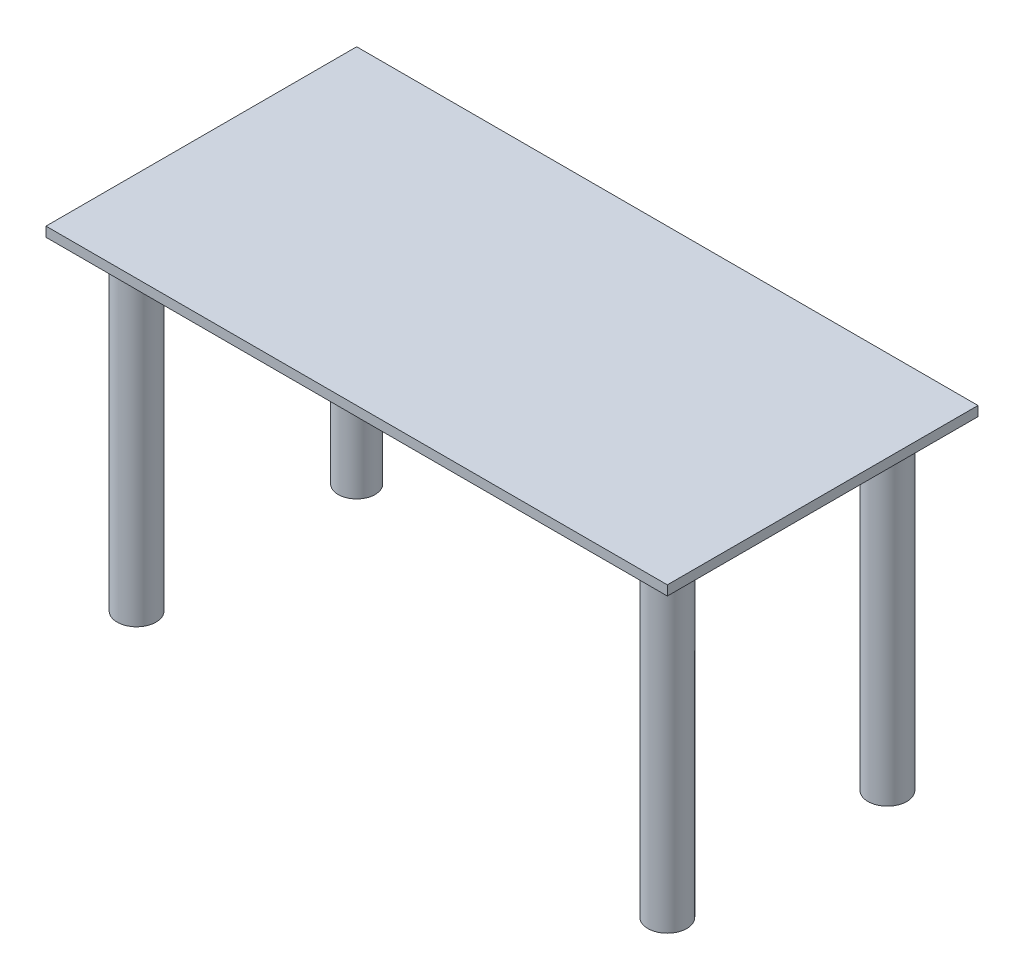
ISO-10303-21;
HEADER;
FILE_DESCRIPTION(('STEP AP214'),'2;1');
FILE_NAME('part.step','',(''),(''),'','','');
FILE_SCHEMA(('AUTOMOTIVE_DESIGN { 1 0 10303 214 1 1 1 1 }'));
ENDSEC;
DATA;
#1=APPLICATION_CONTEXT('core data for automotive mechanical design processes');
#2=APPLICATION_PROTOCOL_DEFINITION('international standard','automotive_design',2000,#1);
#3=PRODUCT_CONTEXT('',#1,'mechanical');
#4=PRODUCT('Part','Part','',(#3));
#5=PRODUCT_RELATED_PRODUCT_CATEGORY('part','',(#4));
#6=PRODUCT_DEFINITION_FORMATION('','',#4);
#7=PRODUCT_DEFINITION_CONTEXT('part definition',#1,'design');
#8=PRODUCT_DEFINITION('design','',#6,#7);
#9=PRODUCT_DEFINITION_SHAPE('','',#8);
#10=(LENGTH_UNIT() NAMED_UNIT(*) SI_UNIT(.MILLI.,.METRE.));
#11=(NAMED_UNIT(*) PLANE_ANGLE_UNIT() SI_UNIT($,.RADIAN.));
#12=(NAMED_UNIT(*) SI_UNIT($,.STERADIAN.) SOLID_ANGLE_UNIT());
#13=UNCERTAINTY_MEASURE_WITH_UNIT(LENGTH_MEASURE(1.E-05),#10,'distance_accuracy_value','');
#14=(GEOMETRIC_REPRESENTATION_CONTEXT(3) GLOBAL_UNCERTAINTY_ASSIGNED_CONTEXT((#13)) GLOBAL_UNIT_ASSIGNED_CONTEXT((#10,
#11,#12)) REPRESENTATION_CONTEXT('',''));
#15=CARTESIAN_POINT('',(0.,0.,0.));
#16=DIRECTION('',(0.,0.,1.));
#17=DIRECTION('',(1.,0.,0.));
#18=AXIS2_PLACEMENT_3D('',#15,#16,#17);
#19=CARTESIAN_POINT('',(609.6,19.05,-304.8));
#20=DIRECTION('',(-1.,0.,0.));
#21=DIRECTION('',(0.,0.,1.));
#22=AXIS2_PLACEMENT_3D('',#19,#20,#21);
#23=PLANE('',#22);
#24=DIRECTION('',(0.,0.,-1.));
#25=VECTOR('',#24,1.);
#26=CARTESIAN_POINT('',(609.6,0.,-304.8));
#27=LINE('',#26,#25);
#28=CARTESIAN_POINT('',(609.6,0.,304.8));
#29=VERTEX_POINT('',#28);
#30=CARTESIAN_POINT('',(609.6,0.,-304.8));
#31=VERTEX_POINT('',#30);
#32=EDGE_CURVE('E102',#29,#31,#27,.T.);
#33=ORIENTED_EDGE('',*,*,#32,.T.);
#34=DIRECTION('',(0.,-1.,0.));
#35=VECTOR('',#34,1.);
#36=CARTESIAN_POINT('',(609.6,19.05,-304.8));
#37=LINE('',#36,#35);
#38=CARTESIAN_POINT('',(609.6,19.05,-304.8));
#39=VERTEX_POINT('',#38);
#40=EDGE_CURVE('E93',#39,#31,#37,.T.);
#41=ORIENTED_EDGE('',*,*,#40,.F.);
#42=DIRECTION('',(0.,0.,-1.));
#43=VECTOR('',#42,1.);
#44=CARTESIAN_POINT('',(609.6,19.05,-304.8));
#45=LINE('',#44,#43);
#46=CARTESIAN_POINT('',(609.6,19.05,304.8));
#47=VERTEX_POINT('',#46);
#48=EDGE_CURVE('E87',#47,#39,#45,.T.);
#49=ORIENTED_EDGE('',*,*,#48,.F.);
#50=DIRECTION('',(0.,-1.,0.));
#51=VECTOR('',#50,1.);
#52=CARTESIAN_POINT('',(609.6,19.05,304.8));
#53=LINE('',#52,#51);
#54=EDGE_CURVE('E98',#47,#29,#53,.T.);
#55=ORIENTED_EDGE('',*,*,#54,.T.);
#56=EDGE_LOOP('',(#33,#41,#49,#55));
#57=FACE_BOUND('',#56,.T.);
#58=ADVANCED_FACE('F33',(#57),#23,.F.);
#59=CARTESIAN_POINT('',(-609.6,19.05,-304.8));
#60=DIRECTION('',(0.,0.,1.));
#61=DIRECTION('',(1.,0.,0.));
#62=AXIS2_PLACEMENT_3D('',#59,#60,#61);
#63=PLANE('',#62);
#64=DIRECTION('',(-1.,0.,0.));
#65=VECTOR('',#64,1.);
#66=CARTESIAN_POINT('',(-609.6,0.,-304.8));
#67=LINE('',#66,#65);
#68=CARTESIAN_POINT('',(-609.6,0.,-304.8));
#69=VERTEX_POINT('',#68);
#70=EDGE_CURVE('E92',#31,#69,#67,.T.);
#71=ORIENTED_EDGE('',*,*,#70,.T.);
#72=DIRECTION('',(0.,-1.,0.));
#73=VECTOR('',#72,1.);
#74=CARTESIAN_POINT('',(-609.6,19.05,-304.8));
#75=LINE('',#74,#73);
#76=CARTESIAN_POINT('',(-609.6,19.05,-304.8));
#77=VERTEX_POINT('',#76);
#78=EDGE_CURVE('E90',#77,#69,#75,.T.);
#79=ORIENTED_EDGE('',*,*,#78,.F.);
#80=DIRECTION('',(-1.,0.,0.));
#81=VECTOR('',#80,1.);
#82=CARTESIAN_POINT('',(-609.6,19.05,-304.8));
#83=LINE('',#82,#81);
#84=EDGE_CURVE('E82',#39,#77,#83,.T.);
#85=ORIENTED_EDGE('',*,*,#84,.F.);
#86=ORIENTED_EDGE('',*,*,#40,.T.);
#87=EDGE_LOOP('',(#71,#79,#85,#86));
#88=FACE_BOUND('',#87,.T.);
#89=ADVANCED_FACE('F91',(#88),#63,.F.);
#90=CARTESIAN_POINT('',(-609.6,19.05,-304.8));
#91=DIRECTION('',(1.,0.,0.));
#92=DIRECTION('',(0.,0.,-1.));
#93=AXIS2_PLACEMENT_3D('',#90,#91,#92);
#94=PLANE('',#93);
#95=DIRECTION('',(0.,0.,1.));
#96=VECTOR('',#95,1.);
#97=CARTESIAN_POINT('',(-609.6,0.,-304.8));
#98=LINE('',#97,#96);
#99=CARTESIAN_POINT('',(-609.6,0.,304.8));
#100=VERTEX_POINT('',#99);
#101=EDGE_CURVE('E68',#69,#100,#98,.T.);
#102=ORIENTED_EDGE('',*,*,#101,.T.);
#103=DIRECTION('',(0.,-1.,0.));
#104=VECTOR('',#103,1.);
#105=CARTESIAN_POINT('',(-609.6,19.05,304.8));
#106=LINE('',#105,#104);
#107=CARTESIAN_POINT('',(-609.6,19.05,304.8));
#108=VERTEX_POINT('',#107);
#109=EDGE_CURVE('E94',#108,#100,#106,.T.);
#110=ORIENTED_EDGE('',*,*,#109,.F.);
#111=DIRECTION('',(0.,0.,1.));
#112=VECTOR('',#111,1.);
#113=CARTESIAN_POINT('',(-609.6,19.05,-304.8));
#114=LINE('',#113,#112);
#115=EDGE_CURVE('E85',#77,#108,#114,.T.);
#116=ORIENTED_EDGE('',*,*,#115,.F.);
#117=ORIENTED_EDGE('',*,*,#78,.T.);
#118=EDGE_LOOP('',(#102,#110,#116,#117));
#119=FACE_BOUND('',#118,.T.);
#120=ADVANCED_FACE('F96',(#119),#94,.F.);
#121=CARTESIAN_POINT('',(-609.6,19.05,304.8));
#122=DIRECTION('',(0.,0.,-1.));
#123=DIRECTION('',(-1.,0.,0.));
#124=AXIS2_PLACEMENT_3D('',#121,#122,#123);
#125=PLANE('',#124);
#126=DIRECTION('',(1.,0.,0.));
#127=VECTOR('',#126,1.);
#128=CARTESIAN_POINT('',(-609.6,0.,304.8));
#129=LINE('',#128,#127);
#130=EDGE_CURVE('E74',#100,#29,#129,.T.);
#131=ORIENTED_EDGE('',*,*,#130,.T.);
#132=ORIENTED_EDGE('',*,*,#54,.F.);
#133=DIRECTION('',(1.,0.,0.));
#134=VECTOR('',#133,1.);
#135=CARTESIAN_POINT('',(-609.6,19.05,304.8));
#136=LINE('',#135,#134);
#137=EDGE_CURVE('E51',#108,#47,#136,.T.);
#138=ORIENTED_EDGE('',*,*,#137,.F.);
#139=ORIENTED_EDGE('',*,*,#109,.T.);
#140=EDGE_LOOP('',(#131,#132,#138,#139));
#141=FACE_BOUND('',#140,.T.);
#142=ADVANCED_FACE('F162',(#141),#125,.F.);
#143=CARTESIAN_POINT('',(0.,19.05,0.));
#144=DIRECTION('',(0.,1.,0.));
#145=DIRECTION('',(0.,0.,1.));
#146=AXIS2_PLACEMENT_3D('',#143,#144,#145);
#147=PLANE('',#146);
#148=ORIENTED_EDGE('',*,*,#48,.T.);
#149=ORIENTED_EDGE('',*,*,#84,.T.);
#150=ORIENTED_EDGE('',*,*,#115,.T.);
#151=ORIENTED_EDGE('',*,*,#137,.T.);
#152=EDGE_LOOP('',(#148,#149,#150,#151));
#153=FACE_BOUND('',#152,.T.);
#154=ADVANCED_FACE('F83',(#153),#147,.T.);
#155=CARTESIAN_POINT('',(0.,0.,0.));
#156=DIRECTION('',(0.,1.,0.));
#157=DIRECTION('',(0.,0.,1.));
#158=AXIS2_PLACEMENT_3D('',#155,#156,#157);
#159=PLANE('',#158);
#160=CARTESIAN_POINT('',(520.7,0.,-215.9));
#161=DIRECTION('',(0.,1.,0.));
#162=DIRECTION('',(0.,0.,1.));
#163=AXIS2_PLACEMENT_3D('',#160,#161,#162);
#164=CIRCLE('',#163,63.5);
#165=CARTESIAN_POINT('',(520.7,0.,-152.4));
#166=VERTEX_POINT('',#165);
#167=EDGE_CURVE('E36',#166,#166,#164,.F.);
#168=ORIENTED_EDGE('',*,*,#167,.F.);
#169=EDGE_LOOP('',(#168));
#170=FACE_BOUND('',#169,.T.);
#171=CARTESIAN_POINT('',(520.7,0.,215.9));
#172=DIRECTION('',(0.,1.,0.));
#173=DIRECTION('',(0.,0.,1.));
#174=AXIS2_PLACEMENT_3D('',#171,#172,#173);
#175=CIRCLE('',#174,63.5);
#176=CARTESIAN_POINT('',(520.7,0.,279.4));
#177=VERTEX_POINT('',#176);
#178=EDGE_CURVE('E117',#177,#177,#175,.F.);
#179=ORIENTED_EDGE('',*,*,#178,.F.);
#180=EDGE_LOOP('',(#179));
#181=FACE_BOUND('',#180,.T.);
#182=CARTESIAN_POINT('',(-520.7,0.,-215.9));
#183=DIRECTION('',(0.,1.,0.));
#184=DIRECTION('',(0.,0.,1.));
#185=AXIS2_PLACEMENT_3D('',#182,#183,#184);
#186=CIRCLE('',#185,63.5);
#187=CARTESIAN_POINT('',(-520.7,0.,-152.4));
#188=VERTEX_POINT('',#187);
#189=EDGE_CURVE('E115',#188,#188,#186,.F.);
#190=ORIENTED_EDGE('',*,*,#189,.F.);
#191=EDGE_LOOP('',(#190));
#192=FACE_BOUND('',#191,.T.);
#193=CARTESIAN_POINT('',(-520.7,0.,215.9));
#194=DIRECTION('',(0.,1.,0.));
#195=DIRECTION('',(0.,0.,1.));
#196=AXIS2_PLACEMENT_3D('',#193,#194,#195);
#197=CIRCLE('',#196,63.5);
#198=CARTESIAN_POINT('',(-520.7,0.,279.4));
#199=VERTEX_POINT('',#198);
#200=EDGE_CURVE('E112',#199,#199,#197,.F.);
#201=ORIENTED_EDGE('',*,*,#200,.F.);
#202=EDGE_LOOP('',(#201));
#203=FACE_BOUND('',#202,.T.);
#204=ORIENTED_EDGE('',*,*,#32,.F.);
#205=ORIENTED_EDGE('',*,*,#130,.F.);
#206=ORIENTED_EDGE('',*,*,#101,.F.);
#207=ORIENTED_EDGE('',*,*,#70,.F.);
#208=EDGE_LOOP('',(#204,#205,#206,#207));
#209=FACE_BOUND('',#208,.T.);
#210=ADVANCED_FACE('F152',(#170,#181,#192,#203,#209),#159,.F.);
#211=CARTESIAN_POINT('',(-520.7,-25.4,215.9));
#212=DIRECTION('',(0.,1.,0.));
#213=DIRECTION('',(0.,0.,1.));
#214=AXIS2_PLACEMENT_3D('',#211,#212,#213);
#215=CYLINDRICAL_SURFACE('',#214,63.5);
#216=CARTESIAN_POINT('',(-520.7,-25.4,215.9));
#217=DIRECTION('',(0.,-1.,0.));
#218=DIRECTION('',(0.,0.,-1.));
#219=AXIS2_PLACEMENT_3D('',#216,#217,#218);
#220=CIRCLE('',#219,63.5);
#221=CARTESIAN_POINT('',(-520.7,-25.4,152.4));
#222=VERTEX_POINT('',#221);
#223=EDGE_CURVE('E105',#222,#222,#220,.T.);
#224=ORIENTED_EDGE('',*,*,#223,.F.);
#225=EDGE_LOOP('',(#224));
#226=FACE_BOUND('',#225,.T.);
#227=ORIENTED_EDGE('',*,*,#200,.T.);
#228=EDGE_LOOP('',(#227));
#229=FACE_BOUND('',#228,.T.);
#230=ADVANCED_FACE('F149',(#226,#229),#215,.T.);
#231=CARTESIAN_POINT('',(-520.7,-25.4,215.9));
#232=DIRECTION('',(0.,-1.,0.));
#233=DIRECTION('',(0.,0.,-1.));
#234=AXIS2_PLACEMENT_3D('',#231,#232,#233);
#235=PLANE('',#234);
#236=CARTESIAN_POINT('',(-520.7,-25.4,215.9));
#237=DIRECTION('',(0.,-1.,0.));
#238=DIRECTION('',(0.,0.,-1.));
#239=AXIS2_PLACEMENT_3D('',#236,#237,#238);
#240=CIRCLE('',#239,38.1);
#241=CARTESIAN_POINT('',(-520.7,-25.4,177.8));
#242=VERTEX_POINT('',#241);
#243=EDGE_CURVE('E122',#242,#242,#240,.T.);
#244=ORIENTED_EDGE('',*,*,#243,.F.);
#245=EDGE_LOOP('',(#244));
#246=FACE_BOUND('',#245,.T.);
#247=ORIENTED_EDGE('',*,*,#223,.T.);
#248=EDGE_LOOP('',(#247));
#249=FACE_BOUND('',#248,.T.);
#250=ADVANCED_FACE('F147',(#246,#249),#235,.T.);
#251=CARTESIAN_POINT('',(-520.7,-25.4,-215.9));
#252=DIRECTION('',(0.,1.,0.));
#253=DIRECTION('',(0.,0.,1.));
#254=AXIS2_PLACEMENT_3D('',#251,#252,#253);
#255=CYLINDRICAL_SURFACE('',#254,63.5);
#256=CARTESIAN_POINT('',(-520.7,-25.4,-215.9));
#257=DIRECTION('',(0.,-1.,0.));
#258=DIRECTION('',(0.,0.,-1.));
#259=AXIS2_PLACEMENT_3D('',#256,#257,#258);
#260=CIRCLE('',#259,63.5);
#261=CARTESIAN_POINT('',(-520.7,-25.4,-279.4));
#262=VERTEX_POINT('',#261);
#263=EDGE_CURVE('E141',#262,#262,#260,.T.);
#264=ORIENTED_EDGE('',*,*,#263,.F.);
#265=EDGE_LOOP('',(#264));
#266=FACE_BOUND('',#265,.T.);
#267=ORIENTED_EDGE('',*,*,#189,.T.);
#268=EDGE_LOOP('',(#267));
#269=FACE_BOUND('',#268,.T.);
#270=ADVANCED_FACE('F210',(#266,#269),#255,.T.);
#271=CARTESIAN_POINT('',(-520.7,-25.4,-215.9));
#272=DIRECTION('',(0.,-1.,0.));
#273=DIRECTION('',(0.,0.,-1.));
#274=AXIS2_PLACEMENT_3D('',#271,#272,#273);
#275=PLANE('',#274);
#276=CARTESIAN_POINT('',(-520.7,-25.4,-215.9));
#277=DIRECTION('',(0.,-1.,0.));
#278=DIRECTION('',(0.,0.,-1.));
#279=AXIS2_PLACEMENT_3D('',#276,#277,#278);
#280=CIRCLE('',#279,36.1654569981669);
#281=CARTESIAN_POINT('',(-520.7,-25.4,-252.065456998167));
#282=VERTEX_POINT('',#281);
#283=EDGE_CURVE('E126',#282,#282,#280,.T.);
#284=ORIENTED_EDGE('',*,*,#283,.F.);
#285=EDGE_LOOP('',(#284));
#286=FACE_BOUND('',#285,.T.);
#287=ORIENTED_EDGE('',*,*,#263,.T.);
#288=EDGE_LOOP('',(#287));
#289=FACE_BOUND('',#288,.T.);
#290=ADVANCED_FACE('F215',(#286,#289),#275,.T.);
#291=CARTESIAN_POINT('',(520.7,-25.4,215.9));
#292=DIRECTION('',(0.,1.,0.));
#293=DIRECTION('',(0.,0.,1.));
#294=AXIS2_PLACEMENT_3D('',#291,#292,#293);
#295=CYLINDRICAL_SURFACE('',#294,63.5);
#296=CARTESIAN_POINT('',(520.7,-25.4,215.9));
#297=DIRECTION('',(0.,-1.,0.));
#298=DIRECTION('',(0.,0.,-1.));
#299=AXIS2_PLACEMENT_3D('',#296,#297,#298);
#300=CIRCLE('',#299,63.5);
#301=CARTESIAN_POINT('',(520.7,-25.4,152.4));
#302=VERTEX_POINT('',#301);
#303=EDGE_CURVE('E138',#302,#302,#300,.T.);
#304=ORIENTED_EDGE('',*,*,#303,.F.);
#305=EDGE_LOOP('',(#304));
#306=FACE_BOUND('',#305,.T.);
#307=ORIENTED_EDGE('',*,*,#178,.T.);
#308=EDGE_LOOP('',(#307));
#309=FACE_BOUND('',#308,.T.);
#310=ADVANCED_FACE('F223',(#306,#309),#295,.T.);
#311=CARTESIAN_POINT('',(520.7,-25.4,215.9));
#312=DIRECTION('',(0.,-1.,0.));
#313=DIRECTION('',(0.,0.,-1.));
#314=AXIS2_PLACEMENT_3D('',#311,#312,#313);
#315=PLANE('',#314);
#316=CARTESIAN_POINT('',(520.7,-25.4,215.9));
#317=DIRECTION('',(0.,-1.,0.));
#318=DIRECTION('',(0.,0.,-1.));
#319=AXIS2_PLACEMENT_3D('',#316,#317,#318);
#320=CIRCLE('',#319,38.1000000000001);
#321=CARTESIAN_POINT('',(520.7,-25.4,177.8));
#322=VERTEX_POINT('',#321);
#323=EDGE_CURVE('E42',#322,#322,#320,.T.);
#324=ORIENTED_EDGE('',*,*,#323,.F.);
#325=EDGE_LOOP('',(#324));
#326=FACE_BOUND('',#325,.T.);
#327=ORIENTED_EDGE('',*,*,#303,.T.);
#328=EDGE_LOOP('',(#327));
#329=FACE_BOUND('',#328,.T.);
#330=ADVANCED_FACE('F228',(#326,#329),#315,.T.);
#331=CARTESIAN_POINT('',(520.7,-25.4,-215.9));
#332=DIRECTION('',(0.,1.,0.));
#333=DIRECTION('',(0.,0.,1.));
#334=AXIS2_PLACEMENT_3D('',#331,#332,#333);
#335=CYLINDRICAL_SURFACE('',#334,63.5);
#336=CARTESIAN_POINT('',(520.7,-25.4,-215.9));
#337=DIRECTION('',(0.,-1.,0.));
#338=DIRECTION('',(0.,0.,-1.));
#339=AXIS2_PLACEMENT_3D('',#336,#337,#338);
#340=CIRCLE('',#339,63.5);
#341=CARTESIAN_POINT('',(520.7,-25.4,-279.4));
#342=VERTEX_POINT('',#341);
#343=EDGE_CURVE('E135',#342,#342,#340,.T.);
#344=ORIENTED_EDGE('',*,*,#343,.F.);
#345=EDGE_LOOP('',(#344));
#346=FACE_BOUND('',#345,.T.);
#347=ORIENTED_EDGE('',*,*,#167,.T.);
#348=EDGE_LOOP('',(#347));
#349=FACE_BOUND('',#348,.T.);
#350=ADVANCED_FACE('F236',(#346,#349),#335,.T.);
#351=CARTESIAN_POINT('',(520.7,-25.4,-215.9));
#352=DIRECTION('',(0.,-1.,0.));
#353=DIRECTION('',(0.,0.,-1.));
#354=AXIS2_PLACEMENT_3D('',#351,#352,#353);
#355=PLANE('',#354);
#356=CARTESIAN_POINT('',(520.7,-25.4,-215.9));
#357=DIRECTION('',(0.,-1.,0.));
#358=DIRECTION('',(0.,0.,-1.));
#359=AXIS2_PLACEMENT_3D('',#356,#357,#358);
#360=CIRCLE('',#359,38.1000000000001);
#361=CARTESIAN_POINT('',(520.7,-25.4,-254.));
#362=VERTEX_POINT('',#361);
#363=EDGE_CURVE('E11',#362,#362,#360,.T.);
#364=ORIENTED_EDGE('',*,*,#363,.F.);
#365=EDGE_LOOP('',(#364));
#366=FACE_BOUND('',#365,.T.);
#367=ORIENTED_EDGE('',*,*,#343,.T.);
#368=EDGE_LOOP('',(#367));
#369=FACE_BOUND('',#368,.T.);
#370=ADVANCED_FACE('F241',(#366,#369),#355,.T.);
#371=CARTESIAN_POINT('',(-520.7,-635.,215.9));
#372=DIRECTION('',(0.,1.,0.));
#373=DIRECTION('',(0.,0.,1.));
#374=AXIS2_PLACEMENT_3D('',#371,#372,#373);
#375=CYLINDRICAL_SURFACE('',#374,38.1);
#376=CARTESIAN_POINT('',(-520.7,-635.,215.9));
#377=DIRECTION('',(0.,-1.,0.));
#378=DIRECTION('',(0.,0.,-1.));
#379=AXIS2_PLACEMENT_3D('',#376,#377,#378);
#380=CIRCLE('',#379,38.1);
#381=CARTESIAN_POINT('',(-520.7,-635.,177.8));
#382=VERTEX_POINT('',#381);
#383=EDGE_CURVE('E134',#382,#382,#380,.T.);
#384=ORIENTED_EDGE('',*,*,#383,.F.);
#385=EDGE_LOOP('',(#384));
#386=FACE_BOUND('',#385,.T.);
#387=ORIENTED_EDGE('',*,*,#243,.T.);
#388=EDGE_LOOP('',(#387));
#389=FACE_BOUND('',#388,.T.);
#390=ADVANCED_FACE('F272',(#386,#389),#375,.T.);
#391=CARTESIAN_POINT('',(-520.7,-635.,215.9));
#392=DIRECTION('',(0.,-1.,0.));
#393=DIRECTION('',(0.,0.,-1.));
#394=AXIS2_PLACEMENT_3D('',#391,#392,#393);
#395=PLANE('',#394);
#396=CARTESIAN_POINT('',(-520.7,-635.,215.9));
#397=DIRECTION('',(0.,-1.,0.));
#398=DIRECTION('',(0.,0.,-1.));
#399=AXIS2_PLACEMENT_3D('',#396,#397,#398);
#400=CIRCLE('',#399,31.75);
#401=CARTESIAN_POINT('',(-520.7,-635.,184.15));
#402=VERTEX_POINT('',#401);
#403=EDGE_CURVE('E440',#402,#402,#400,.T.);
#404=ORIENTED_EDGE('',*,*,#403,.F.);
#405=EDGE_LOOP('',(#404));
#406=FACE_BOUND('',#405,.T.);
#407=ORIENTED_EDGE('',*,*,#383,.T.);
#408=EDGE_LOOP('',(#407));
#409=FACE_BOUND('',#408,.T.);
#410=ADVANCED_FACE('F282',(#406,#409),#395,.T.);
#411=CARTESIAN_POINT('',(-520.7,-635.,-215.9));
#412=DIRECTION('',(0.,1.,0.));
#413=DIRECTION('',(0.,0.,1.));
#414=AXIS2_PLACEMENT_3D('',#411,#412,#413);
#415=CYLINDRICAL_SURFACE('',#414,36.1654569981669);
#416=CARTESIAN_POINT('',(-520.7,-635.,-215.9));
#417=DIRECTION('',(0.,-1.,0.));
#418=DIRECTION('',(0.,0.,-1.));
#419=AXIS2_PLACEMENT_3D('',#416,#417,#418);
#420=CIRCLE('',#419,36.1654569981669);
#421=CARTESIAN_POINT('',(-520.7,-635.,-252.065456998167));
#422=VERTEX_POINT('',#421);
#423=EDGE_CURVE('E454',#422,#422,#420,.T.);
#424=ORIENTED_EDGE('',*,*,#423,.F.);
#425=EDGE_LOOP('',(#424));
#426=FACE_BOUND('',#425,.T.);
#427=ORIENTED_EDGE('',*,*,#283,.T.);
#428=EDGE_LOOP('',(#427));
#429=FACE_BOUND('',#428,.T.);
#430=ADVANCED_FACE('F290',(#426,#429),#415,.T.);
#431=CARTESIAN_POINT('',(-520.7,-635.,-215.9));
#432=DIRECTION('',(0.,-1.,0.));
#433=DIRECTION('',(0.,0.,-1.));
#434=AXIS2_PLACEMENT_3D('',#431,#432,#433);
#435=PLANE('',#434);
#436=CARTESIAN_POINT('',(-520.7,-635.,-215.9));
#437=DIRECTION('',(0.,-1.,0.));
#438=DIRECTION('',(0.,0.,-1.));
#439=AXIS2_PLACEMENT_3D('',#436,#437,#438);
#440=CIRCLE('',#439,31.75);
#441=CARTESIAN_POINT('',(-520.7,-635.,-247.65));
#442=VERTEX_POINT('',#441);
#443=EDGE_CURVE('E449',#442,#442,#440,.T.);
#444=ORIENTED_EDGE('',*,*,#443,.F.);
#445=EDGE_LOOP('',(#444));
#446=FACE_BOUND('',#445,.T.);
#447=ORIENTED_EDGE('',*,*,#423,.T.);
#448=EDGE_LOOP('',(#447));
#449=FACE_BOUND('',#448,.T.);
#450=ADVANCED_FACE('F295',(#446,#449),#435,.T.);
#451=CARTESIAN_POINT('',(520.7,-635.,215.9));
#452=DIRECTION('',(0.,1.,0.));
#453=DIRECTION('',(0.,0.,1.));
#454=AXIS2_PLACEMENT_3D('',#451,#452,#453);
#455=CYLINDRICAL_SURFACE('',#454,38.1000000000001);
#456=CARTESIAN_POINT('',(520.7,-635.,215.9));
#457=DIRECTION('',(0.,-1.,0.));
#458=DIRECTION('',(0.,0.,-1.));
#459=AXIS2_PLACEMENT_3D('',#456,#457,#458);
#460=CIRCLE('',#459,38.1000000000001);
#461=CARTESIAN_POINT('',(520.7,-635.,177.8));
#462=VERTEX_POINT('',#461);
#463=EDGE_CURVE('E443',#462,#462,#460,.T.);
#464=ORIENTED_EDGE('',*,*,#463,.F.);
#465=EDGE_LOOP('',(#464));
#466=FACE_BOUND('',#465,.T.);
#467=ORIENTED_EDGE('',*,*,#323,.T.);
#468=EDGE_LOOP('',(#467));
#469=FACE_BOUND('',#468,.T.);
#470=ADVANCED_FACE('F303',(#466,#469),#455,.T.);
#471=CARTESIAN_POINT('',(520.7,-635.,215.9));
#472=DIRECTION('',(0.,-1.,0.));
#473=DIRECTION('',(0.,0.,-1.));
#474=AXIS2_PLACEMENT_3D('',#471,#472,#473);
#475=PLANE('',#474);
#476=CARTESIAN_POINT('',(520.7,-635.,215.9));
#477=DIRECTION('',(0.,-1.,0.));
#478=DIRECTION('',(0.,0.,-1.));
#479=AXIS2_PLACEMENT_3D('',#476,#477,#478);
#480=CIRCLE('',#479,31.7499999999999);
#481=CARTESIAN_POINT('',(520.7,-635.,184.15));
#482=VERTEX_POINT('',#481);
#483=EDGE_CURVE('E486',#482,#482,#480,.T.);
#484=ORIENTED_EDGE('',*,*,#483,.F.);
#485=EDGE_LOOP('',(#484));
#486=FACE_BOUND('',#485,.T.);
#487=ORIENTED_EDGE('',*,*,#463,.T.);
#488=EDGE_LOOP('',(#487));
#489=FACE_BOUND('',#488,.T.);
#490=ADVANCED_FACE('F308',(#486,#489),#475,.T.);
#491=CARTESIAN_POINT('',(520.7,-635.,-215.9));
#492=DIRECTION('',(0.,1.,0.));
#493=DIRECTION('',(0.,0.,1.));
#494=AXIS2_PLACEMENT_3D('',#491,#492,#493);
#495=CYLINDRICAL_SURFACE('',#494,38.1000000000001);
#496=CARTESIAN_POINT('',(520.7,-635.,-215.9));
#497=DIRECTION('',(0.,-1.,0.));
#498=DIRECTION('',(0.,0.,-1.));
#499=AXIS2_PLACEMENT_3D('',#496,#497,#498);
#500=CIRCLE('',#499,38.1000000000001);
#501=CARTESIAN_POINT('',(520.7,-635.,-254.));
#502=VERTEX_POINT('',#501);
#503=EDGE_CURVE('E439',#502,#502,#500,.T.);
#504=ORIENTED_EDGE('',*,*,#503,.F.);
#505=EDGE_LOOP('',(#504));
#506=FACE_BOUND('',#505,.T.);
#507=ORIENTED_EDGE('',*,*,#363,.T.);
#508=EDGE_LOOP('',(#507));
#509=FACE_BOUND('',#508,.T.);
#510=ADVANCED_FACE('F316',(#506,#509),#495,.T.);
#511=CARTESIAN_POINT('',(520.7,-635.,-215.9));
#512=DIRECTION('',(0.,-1.,0.));
#513=DIRECTION('',(0.,0.,-1.));
#514=AXIS2_PLACEMENT_3D('',#511,#512,#513);
#515=PLANE('',#514);
#516=CARTESIAN_POINT('',(520.7,-635.,-215.9));
#517=DIRECTION('',(0.,-1.,0.));
#518=DIRECTION('',(0.,0.,-1.));
#519=AXIS2_PLACEMENT_3D('',#516,#517,#518);
#520=CIRCLE('',#519,31.7499999999999);
#521=CARTESIAN_POINT('',(520.7,-635.,-247.65));
#522=VERTEX_POINT('',#521);
#523=EDGE_CURVE('E480',#522,#522,#520,.T.);
#524=ORIENTED_EDGE('',*,*,#523,.F.);
#525=EDGE_LOOP('',(#524));
#526=FACE_BOUND('',#525,.T.);
#527=ORIENTED_EDGE('',*,*,#503,.T.);
#528=EDGE_LOOP('',(#527));
#529=FACE_BOUND('',#528,.T.);
#530=ADVANCED_FACE('F321',(#526,#529),#515,.T.);
#531=CARTESIAN_POINT('',(520.7,-50.8000000000001,-215.9));
#532=DIRECTION('',(0.,-1.,0.));
#533=DIRECTION('',(0.,0.,-1.));
#534=AXIS2_PLACEMENT_3D('',#531,#532,#533);
#535=CYLINDRICAL_SURFACE('',#534,31.7499999999999);
#536=CARTESIAN_POINT('',(520.7,-50.8000000000001,-215.9));
#537=DIRECTION('',(0.,-1.,0.));
#538=DIRECTION('',(0.,0.,-1.));
#539=AXIS2_PLACEMENT_3D('',#536,#537,#538);
#540=CIRCLE('',#539,31.7499999999999);
#541=CARTESIAN_POINT('',(520.7,-50.8000000000001,-247.65));
#542=VERTEX_POINT('',#541);
#543=EDGE_CURVE('E483',#542,#542,#540,.T.);
#544=ORIENTED_EDGE('',*,*,#543,.F.);
#545=EDGE_LOOP('',(#544));
#546=FACE_BOUND('',#545,.T.);
#547=ORIENTED_EDGE('',*,*,#523,.T.);
#548=EDGE_LOOP('',(#547));
#549=FACE_BOUND('',#548,.T.);
#550=ADVANCED_FACE('F352',(#546,#549),#535,.F.);
#551=CARTESIAN_POINT('',(520.7,-50.8000000000001,-215.9));
#552=DIRECTION('',(0.,-1.,0.));
#553=DIRECTION('',(0.,0.,-1.));
#554=AXIS2_PLACEMENT_3D('',#551,#552,#553);
#555=PLANE('',#554);
#556=ORIENTED_EDGE('',*,*,#543,.T.);
#557=EDGE_LOOP('',(#556));
#558=FACE_BOUND('',#557,.T.);
#559=ADVANCED_FACE('F362',(#558),#555,.T.);
#560=CARTESIAN_POINT('',(520.7,-50.8000000000001,215.9));
#561=DIRECTION('',(0.,-1.,0.));
#562=DIRECTION('',(0.,0.,-1.));
#563=AXIS2_PLACEMENT_3D('',#560,#561,#562);
#564=CYLINDRICAL_SURFACE('',#563,31.7499999999999);
#565=CARTESIAN_POINT('',(520.7,-50.8000000000001,215.9));
#566=DIRECTION('',(0.,-1.,0.));
#567=DIRECTION('',(0.,0.,-1.));
#568=AXIS2_PLACEMENT_3D('',#565,#566,#567);
#569=CIRCLE('',#568,31.7499999999999);
#570=CARTESIAN_POINT('',(520.7,-50.8000000000001,184.15));
#571=VERTEX_POINT('',#570);
#572=EDGE_CURVE('E446',#571,#571,#569,.T.);
#573=ORIENTED_EDGE('',*,*,#572,.F.);
#574=EDGE_LOOP('',(#573));
#575=FACE_BOUND('',#574,.T.);
#576=ORIENTED_EDGE('',*,*,#483,.T.);
#577=EDGE_LOOP('',(#576));
#578=FACE_BOUND('',#577,.T.);
#579=ADVANCED_FACE('F372',(#575,#578),#564,.F.);
#580=CARTESIAN_POINT('',(520.7,-50.8000000000001,215.9));
#581=DIRECTION('',(0.,-1.,0.));
#582=DIRECTION('',(0.,0.,-1.));
#583=AXIS2_PLACEMENT_3D('',#580,#581,#582);
#584=PLANE('',#583);
#585=ORIENTED_EDGE('',*,*,#572,.T.);
#586=EDGE_LOOP('',(#585));
#587=FACE_BOUND('',#586,.T.);
#588=ADVANCED_FACE('F382',(#587),#584,.T.);
#589=CARTESIAN_POINT('',(-520.7,-50.8000000000001,-215.9));
#590=DIRECTION('',(0.,-1.,0.));
#591=DIRECTION('',(0.,0.,-1.));
#592=AXIS2_PLACEMENT_3D('',#589,#590,#591);
#593=CYLINDRICAL_SURFACE('',#592,31.75);
#594=CARTESIAN_POINT('',(-520.7,-50.8000000000001,-215.9));
#595=DIRECTION('',(0.,-1.,0.));
#596=DIRECTION('',(0.,0.,-1.));
#597=AXIS2_PLACEMENT_3D('',#594,#595,#596);
#598=CIRCLE('',#597,31.75);
#599=CARTESIAN_POINT('',(-520.7,-50.8000000000001,-247.65));
#600=VERTEX_POINT('',#599);
#601=EDGE_CURVE('E477',#600,#600,#598,.T.);
#602=ORIENTED_EDGE('',*,*,#601,.F.);
#603=EDGE_LOOP('',(#602));
#604=FACE_BOUND('',#603,.T.);
#605=ORIENTED_EDGE('',*,*,#443,.T.);
#606=EDGE_LOOP('',(#605));
#607=FACE_BOUND('',#606,.T.);
#608=ADVANCED_FACE('F392',(#604,#607),#593,.F.);
#609=CARTESIAN_POINT('',(-520.7,-50.8000000000001,-215.9));
#610=DIRECTION('',(0.,-1.,0.));
#611=DIRECTION('',(0.,0.,-1.));
#612=AXIS2_PLACEMENT_3D('',#609,#610,#611);
#613=PLANE('',#612);
#614=ORIENTED_EDGE('',*,*,#601,.T.);
#615=EDGE_LOOP('',(#614));
#616=FACE_BOUND('',#615,.T.);
#617=ADVANCED_FACE('F402',(#616),#613,.T.);
#618=CARTESIAN_POINT('',(-520.7,-50.8000000000001,215.9));
#619=DIRECTION('',(0.,-1.,0.));
#620=DIRECTION('',(0.,0.,-1.));
#621=AXIS2_PLACEMENT_3D('',#618,#619,#620);
#622=CYLINDRICAL_SURFACE('',#621,31.75);
#623=CARTESIAN_POINT('',(-520.7,-50.8000000000001,215.9));
#624=DIRECTION('',(0.,-1.,0.));
#625=DIRECTION('',(0.,0.,-1.));
#626=AXIS2_PLACEMENT_3D('',#623,#624,#625);
#627=CIRCLE('',#626,31.75);
#628=CARTESIAN_POINT('',(-520.7,-50.8000000000001,184.15));
#629=VERTEX_POINT('',#628);
#630=EDGE_CURVE('E438',#629,#629,#627,.T.);
#631=ORIENTED_EDGE('',*,*,#630,.F.);
#632=EDGE_LOOP('',(#631));
#633=FACE_BOUND('',#632,.T.);
#634=ORIENTED_EDGE('',*,*,#403,.T.);
#635=EDGE_LOOP('',(#634));
#636=FACE_BOUND('',#635,.T.);
#637=ADVANCED_FACE('F412',(#633,#636),#622,.F.);
#638=CARTESIAN_POINT('',(-520.7,-50.8000000000001,215.9));
#639=DIRECTION('',(0.,-1.,0.));
#640=DIRECTION('',(0.,0.,-1.));
#641=AXIS2_PLACEMENT_3D('',#638,#639,#640);
#642=PLANE('',#641);
#643=ORIENTED_EDGE('',*,*,#630,.T.);
#644=EDGE_LOOP('',(#643));
#645=FACE_BOUND('',#644,.T.);
#646=ADVANCED_FACE('F422',(#645),#642,.T.);
#647=CLOSED_SHELL('',(#58,#89,#120,#142,#154,#210,#230,#250,#270,#290,#310,#330,#350,#370,#390,
#410,#430,#450,#470,#490,#510,#530,#550,#559,#579,#588,#608,#617,#637,#646));
#648=MANIFOLD_SOLID_BREP('B2',#647);
#649=ADVANCED_BREP_SHAPE_REPRESENTATION('',(#18,#648),#14);
#650=SHAPE_DEFINITION_REPRESENTATION(#9,#649);
ENDSEC;
END-ISO-10303-21;
